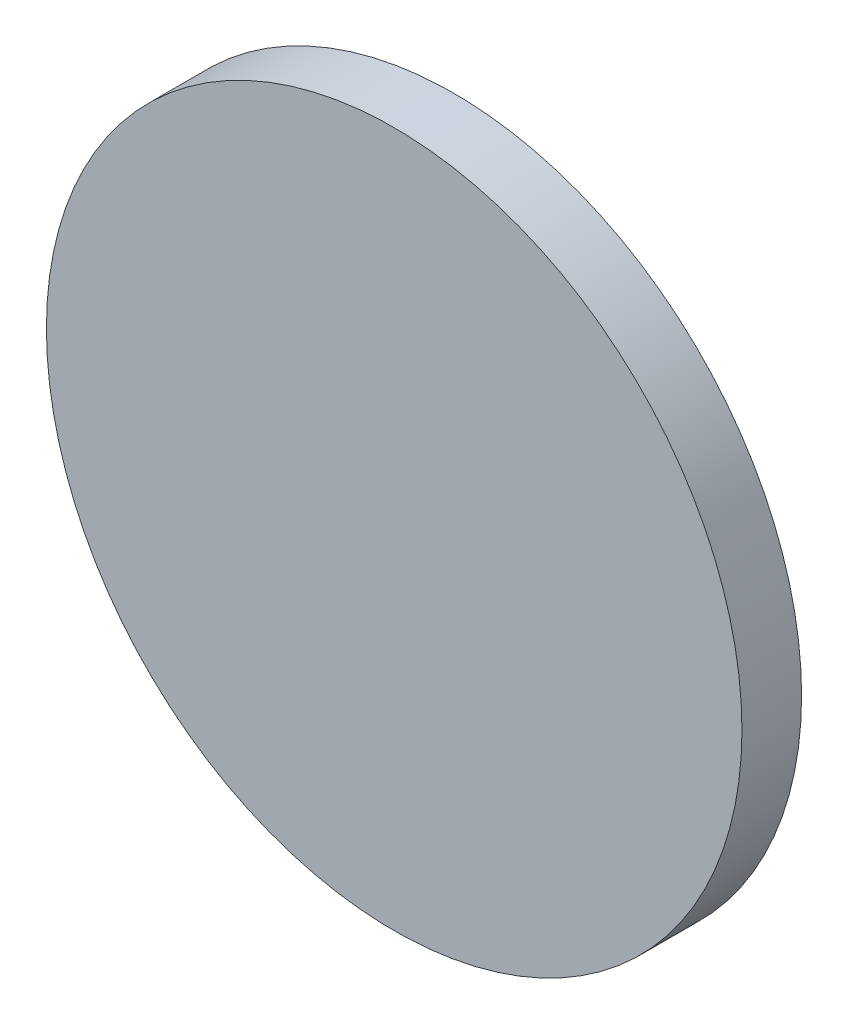
ISO-10303-21;
HEADER;
FILE_DESCRIPTION(('STEP AP214'),'2;1');
FILE_NAME('part.step','',(''),(''),'','','');
FILE_SCHEMA(('AUTOMOTIVE_DESIGN { 1 0 10303 214 1 1 1 1 }'));
ENDSEC;
DATA;
#1=APPLICATION_CONTEXT('core data for automotive mechanical design processes');
#2=APPLICATION_PROTOCOL_DEFINITION('international standard','automotive_design',2000,#1);
#3=PRODUCT_CONTEXT('',#1,'mechanical');
#4=PRODUCT('Part','Part','',(#3));
#5=PRODUCT_RELATED_PRODUCT_CATEGORY('part','',(#4));
#6=PRODUCT_DEFINITION_FORMATION('','',#4);
#7=PRODUCT_DEFINITION_CONTEXT('part definition',#1,'design');
#8=PRODUCT_DEFINITION('design','',#6,#7);
#9=PRODUCT_DEFINITION_SHAPE('','',#8);
#10=(LENGTH_UNIT() NAMED_UNIT(*) SI_UNIT(.MILLI.,.METRE.));
#11=(NAMED_UNIT(*) PLANE_ANGLE_UNIT() SI_UNIT($,.RADIAN.));
#12=(NAMED_UNIT(*) SI_UNIT($,.STERADIAN.) SOLID_ANGLE_UNIT());
#13=UNCERTAINTY_MEASURE_WITH_UNIT(LENGTH_MEASURE(1.E-05),#10,'distance_accuracy_value','');
#14=(GEOMETRIC_REPRESENTATION_CONTEXT(3) GLOBAL_UNCERTAINTY_ASSIGNED_CONTEXT((#13)) GLOBAL_UNIT_ASSIGNED_CONTEXT((#10,
#11,#12)) REPRESENTATION_CONTEXT('',''));
#15=CARTESIAN_POINT('',(0.,0.,0.));
#16=DIRECTION('',(0.,0.,1.));
#17=DIRECTION('',(1.,0.,0.));
#18=AXIS2_PLACEMENT_3D('',#15,#16,#17);
#19=CARTESIAN_POINT('',(0.,0.,0.));
#20=DIRECTION('',(0.,0.,-1.));
#21=DIRECTION('',(-1.,0.,0.));
#22=AXIS2_PLACEMENT_3D('',#19,#20,#21);
#23=PLANE('',#22);
#24=CARTESIAN_POINT('',(0.,0.,0.));
#25=DIRECTION('',(0.,0.,1.));
#26=DIRECTION('',(1.,0.,0.));
#27=AXIS2_PLACEMENT_3D('',#24,#25,#26);
#28=CIRCLE('',#27,66.675);
#29=CARTESIAN_POINT('',(66.675,0.,0.));
#30=VERTEX_POINT('',#29);
#31=EDGE_CURVE('E10',#30,#30,#28,.T.);
#32=ORIENTED_EDGE('',*,*,#31,.T.);
#33=EDGE_LOOP('',(#32));
#34=FACE_BOUND('',#33,.T.);
#35=ADVANCED_FACE('F32',(#34),#23,.F.);
#36=CARTESIAN_POINT('',(0.,0.,0.));
#37=DIRECTION('',(0.,0.,1.));
#38=DIRECTION('',(1.,0.,0.));
#39=AXIS2_PLACEMENT_3D('',#36,#37,#38);
#40=CYLINDRICAL_SURFACE('',#39,66.675);
#41=ORIENTED_EDGE('',*,*,#31,.F.);
#42=EDGE_LOOP('',(#41));
#43=FACE_BOUND('',#42,.T.);
#44=CARTESIAN_POINT('',(0.,0.,-11.43));
#45=DIRECTION('',(0.,0.,1.));
#46=DIRECTION('',(1.,0.,0.));
#47=AXIS2_PLACEMENT_3D('',#44,#45,#46);
#48=CIRCLE('',#47,66.675);
#49=CARTESIAN_POINT('',(66.675,0.,-11.43));
#50=VERTEX_POINT('',#49);
#51=EDGE_CURVE('E38',#50,#50,#48,.T.);
#52=ORIENTED_EDGE('',*,*,#51,.T.);
#53=EDGE_LOOP('',(#52));
#54=FACE_BOUND('',#53,.T.);
#55=ADVANCED_FACE('F64',(#43,#54),#40,.T.);
#56=CARTESIAN_POINT('',(0.,66.675,-11.43));
#57=DIRECTION('',(0.,0.,1.));
#58=DIRECTION('',(1.,0.,0.));
#59=AXIS2_PLACEMENT_3D('',#56,#57,#58);
#60=PLANE('',#59);
#61=ORIENTED_EDGE('',*,*,#51,.F.);
#62=EDGE_LOOP('',(#61));
#63=FACE_BOUND('',#62,.T.);
#64=CARTESIAN_POINT('',(0.,0.,-11.43));
#65=DIRECTION('',(0.,0.,1.));
#66=DIRECTION('',(1.,0.,0.));
#67=AXIS2_PLACEMENT_3D('',#64,#65,#66);
#68=CIRCLE('',#67,63.5);
#69=CARTESIAN_POINT('',(63.5,0.,-11.43));
#70=VERTEX_POINT('',#69);
#71=EDGE_CURVE('E42',#70,#70,#68,.T.);
#72=ORIENTED_EDGE('',*,*,#71,.T.);
#73=EDGE_LOOP('',(#72));
#74=FACE_BOUND('',#73,.T.);
#75=ADVANCED_FACE('F60',(#63,#74),#60,.F.);
#76=CARTESIAN_POINT('',(0.,0.,0.));
#77=DIRECTION('',(0.,0.,1.));
#78=DIRECTION('',(1.,0.,0.));
#79=AXIS2_PLACEMENT_3D('',#76,#77,#78);
#80=CYLINDRICAL_SURFACE('',#79,63.5);
#81=ORIENTED_EDGE('',*,*,#71,.F.);
#82=EDGE_LOOP('',(#81));
#83=FACE_BOUND('',#82,.T.);
#84=CARTESIAN_POINT('',(0.,0.,-5.07999999999999));
#85=DIRECTION('',(0.,0.,1.));
#86=DIRECTION('',(1.,0.,0.));
#87=AXIS2_PLACEMENT_3D('',#84,#85,#86);
#88=CIRCLE('',#87,63.5);
#89=CARTESIAN_POINT('',(63.5,0.,-5.07999999999999));
#90=VERTEX_POINT('',#89);
#91=EDGE_CURVE('E46',#90,#90,#88,.T.);
#92=ORIENTED_EDGE('',*,*,#91,.T.);
#93=EDGE_LOOP('',(#92));
#94=FACE_BOUND('',#93,.T.);
#95=ADVANCED_FACE('F52',(#83,#94),#80,.F.);
#96=CARTESIAN_POINT('',(0.,63.5,-5.08));
#97=DIRECTION('',(0.,0.,1.));
#98=DIRECTION('',(1.,0.,0.));
#99=AXIS2_PLACEMENT_3D('',#96,#97,#98);
#100=PLANE('',#99);
#101=ORIENTED_EDGE('',*,*,#91,.F.);
#102=EDGE_LOOP('',(#101));
#103=FACE_BOUND('',#102,.T.);
#104=ADVANCED_FACE('F54',(#103),#100,.F.);
#105=CLOSED_SHELL('',(#35,#55,#75,#95,#104));
#106=MANIFOLD_SOLID_BREP('B2',#105);
#107=ADVANCED_BREP_SHAPE_REPRESENTATION('',(#18,#106),#14);
#108=SHAPE_DEFINITION_REPRESENTATION(#9,#107);
ENDSEC;
END-ISO-10303-21;
